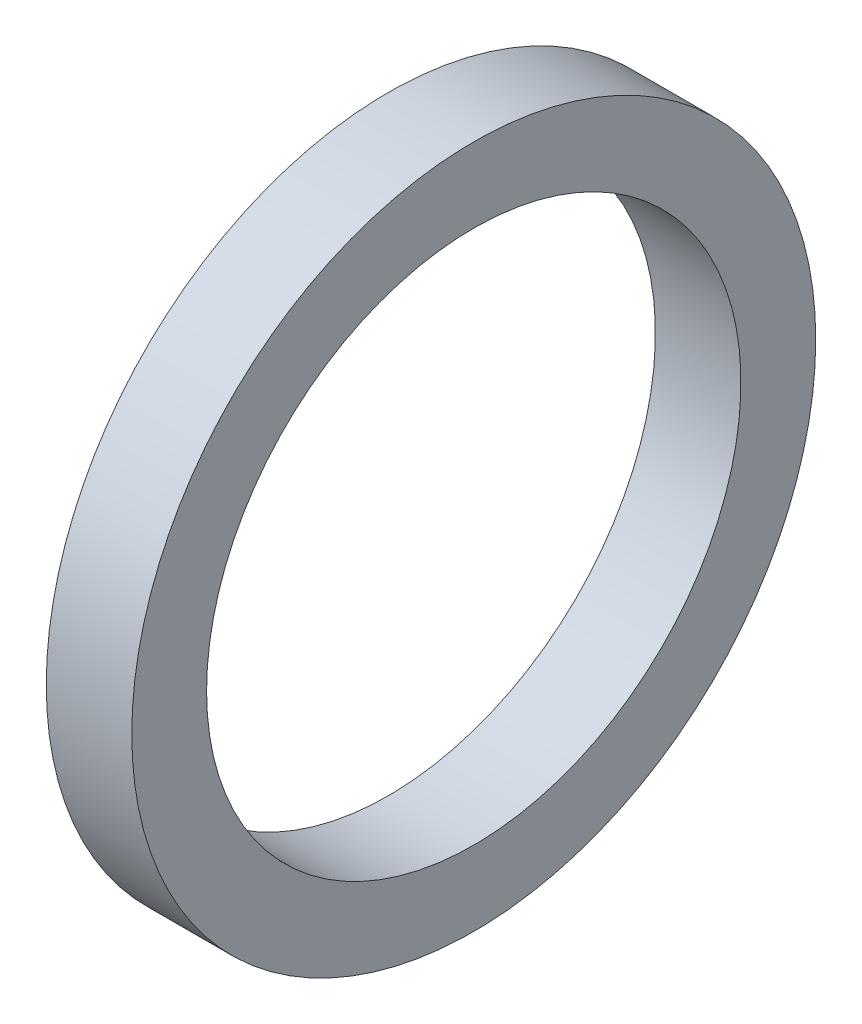
ISO-10303-21;
HEADER;
FILE_DESCRIPTION(('STEP AP214'),'2;1');
FILE_NAME('part.step','',(''),(''),'','','');
FILE_SCHEMA(('AUTOMOTIVE_DESIGN { 1 0 10303 214 1 1 1 1 }'));
ENDSEC;
DATA;
#1=APPLICATION_CONTEXT('core data for automotive mechanical design processes');
#2=APPLICATION_PROTOCOL_DEFINITION('international standard','automotive_design',2000,#1);
#3=PRODUCT_CONTEXT('',#1,'mechanical');
#4=PRODUCT('Part','Part','',(#3));
#5=PRODUCT_RELATED_PRODUCT_CATEGORY('part','',(#4));
#6=PRODUCT_DEFINITION_FORMATION('','',#4);
#7=PRODUCT_DEFINITION_CONTEXT('part definition',#1,'design');
#8=PRODUCT_DEFINITION('design','',#6,#7);
#9=PRODUCT_DEFINITION_SHAPE('','',#8);
#10=(LENGTH_UNIT() NAMED_UNIT(*) SI_UNIT(.MILLI.,.METRE.));
#11=(NAMED_UNIT(*) PLANE_ANGLE_UNIT() SI_UNIT($,.RADIAN.));
#12=(NAMED_UNIT(*) SI_UNIT($,.STERADIAN.) SOLID_ANGLE_UNIT());
#13=UNCERTAINTY_MEASURE_WITH_UNIT(LENGTH_MEASURE(1.E-05),#10,'distance_accuracy_value','');
#14=(GEOMETRIC_REPRESENTATION_CONTEXT(3) GLOBAL_UNCERTAINTY_ASSIGNED_CONTEXT((#13)) GLOBAL_UNIT_ASSIGNED_CONTEXT((#10,
#11,#12)) REPRESENTATION_CONTEXT('',''));
#15=CARTESIAN_POINT('',(0.,0.,0.));
#16=DIRECTION('',(0.,0.,1.));
#17=DIRECTION('',(1.,0.,0.));
#18=AXIS2_PLACEMENT_3D('',#15,#16,#17);
#19=CARTESIAN_POINT('',(2.,16.,0.));
#20=DIRECTION('',(-1.,0.,0.));
#21=DIRECTION('',(0.,0.,1.));
#22=AXIS2_PLACEMENT_3D('',#19,#20,#21);
#23=PLANE('',#22);
#24=CARTESIAN_POINT('',(2.,0.,0.));
#25=DIRECTION('',(-1.,0.,0.));
#26=DIRECTION('',(0.,0.,1.));
#27=AXIS2_PLACEMENT_3D('',#24,#25,#26);
#28=CIRCLE('',#27,16.);
#29=CARTESIAN_POINT('',(2.,0.,16.));
#30=VERTEX_POINT('',#29);
#31=EDGE_CURVE('E10',#30,#30,#28,.T.);
#32=ORIENTED_EDGE('',*,*,#31,.F.);
#33=EDGE_LOOP('',(#32));
#34=FACE_BOUND('',#33,.T.);
#35=CARTESIAN_POINT('',(2.,0.,0.));
#36=DIRECTION('',(-1.,0.,0.));
#37=DIRECTION('',(0.,0.,1.));
#38=AXIS2_PLACEMENT_3D('',#35,#36,#37);
#39=CIRCLE('',#38,12.5);
#40=CARTESIAN_POINT('',(2.,0.,12.5));
#41=VERTEX_POINT('',#40);
#42=EDGE_CURVE('E51',#41,#41,#39,.T.);
#43=ORIENTED_EDGE('',*,*,#42,.T.);
#44=EDGE_LOOP('',(#43));
#45=FACE_BOUND('',#44,.T.);
#46=ADVANCED_FACE('F37',(#34,#45),#23,.F.);
#47=CARTESIAN_POINT('',(0.,0.,0.));
#48=DIRECTION('',(-1.,0.,0.));
#49=DIRECTION('',(0.,0.,1.));
#50=AXIS2_PLACEMENT_3D('',#47,#48,#49);
#51=CYLINDRICAL_SURFACE('',#50,16.);
#52=CARTESIAN_POINT('',(-2.,0.,0.));
#53=DIRECTION('',(-1.,0.,0.));
#54=DIRECTION('',(0.,0.,1.));
#55=AXIS2_PLACEMENT_3D('',#52,#53,#54);
#56=CIRCLE('',#55,16.);
#57=CARTESIAN_POINT('',(-2.,0.,16.));
#58=VERTEX_POINT('',#57);
#59=EDGE_CURVE('E43',#58,#58,#56,.T.);
#60=ORIENTED_EDGE('',*,*,#59,.F.);
#61=EDGE_LOOP('',(#60));
#62=FACE_BOUND('',#61,.T.);
#63=ORIENTED_EDGE('',*,*,#31,.T.);
#64=EDGE_LOOP('',(#63));
#65=FACE_BOUND('',#64,.T.);
#66=ADVANCED_FACE('F66',(#62,#65),#51,.T.);
#67=CARTESIAN_POINT('',(-2.,16.,0.));
#68=DIRECTION('',(1.,0.,0.));
#69=DIRECTION('',(0.,0.,-1.));
#70=AXIS2_PLACEMENT_3D('',#67,#68,#69);
#71=PLANE('',#70);
#72=CARTESIAN_POINT('',(-2.,0.,0.));
#73=DIRECTION('',(-1.,0.,0.));
#74=DIRECTION('',(0.,0.,1.));
#75=AXIS2_PLACEMENT_3D('',#72,#73,#74);
#76=CIRCLE('',#75,12.5);
#77=CARTESIAN_POINT('',(-2.,0.,12.5));
#78=VERTEX_POINT('',#77);
#79=EDGE_CURVE('E47',#78,#78,#76,.T.);
#80=ORIENTED_EDGE('',*,*,#79,.F.);
#81=EDGE_LOOP('',(#80));
#82=FACE_BOUND('',#81,.T.);
#83=ORIENTED_EDGE('',*,*,#59,.T.);
#84=EDGE_LOOP('',(#83));
#85=FACE_BOUND('',#84,.T.);
#86=ADVANCED_FACE('F61',(#82,#85),#71,.F.);
#87=CARTESIAN_POINT('',(0.,0.,0.));
#88=DIRECTION('',(-1.,0.,0.));
#89=DIRECTION('',(0.,0.,1.));
#90=AXIS2_PLACEMENT_3D('',#87,#88,#89);
#91=CYLINDRICAL_SURFACE('',#90,12.5);
#92=ORIENTED_EDGE('',*,*,#42,.F.);
#93=EDGE_LOOP('',(#92));
#94=FACE_BOUND('',#93,.T.);
#95=ORIENTED_EDGE('',*,*,#79,.T.);
#96=EDGE_LOOP('',(#95));
#97=FACE_BOUND('',#96,.T.);
#98=ADVANCED_FACE('F58',(#94,#97),#91,.F.);
#99=CLOSED_SHELL('',(#46,#66,#86,#98));
#100=MANIFOLD_SOLID_BREP('B2',#99);
#101=ADVANCED_BREP_SHAPE_REPRESENTATION('',(#18,#100),#14);
#102=SHAPE_DEFINITION_REPRESENTATION(#9,#101);
ENDSEC;
END-ISO-10303-21;
